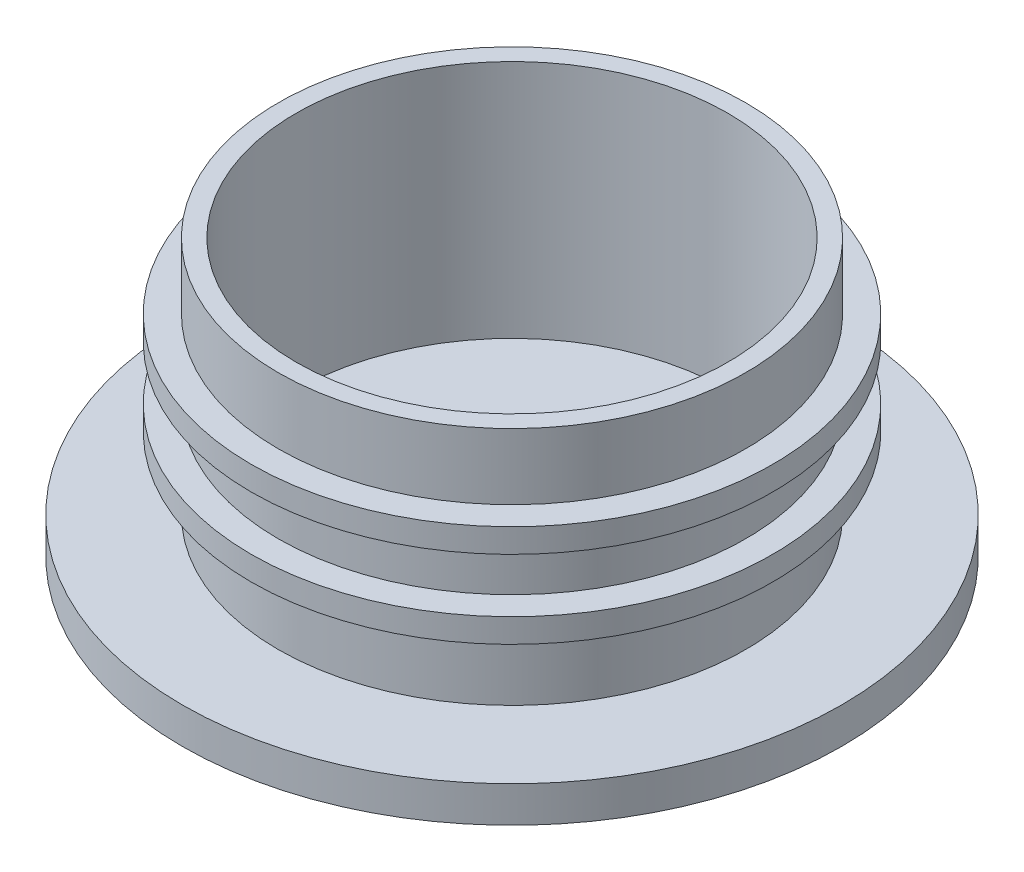
ISO-10303-21;
HEADER;
FILE_DESCRIPTION(('STEP AP214'),'2;1');
FILE_NAME('part.step','',(''),(''),'','','');
FILE_SCHEMA(('AUTOMOTIVE_DESIGN { 1 0 10303 214 1 1 1 1 }'));
ENDSEC;
DATA;
#1=APPLICATION_CONTEXT('core data for automotive mechanical design processes');
#2=APPLICATION_PROTOCOL_DEFINITION('international standard','automotive_design',2000,#1);
#3=PRODUCT_CONTEXT('',#1,'mechanical');
#4=PRODUCT('Part','Part','',(#3));
#5=PRODUCT_RELATED_PRODUCT_CATEGORY('part','',(#4));
#6=PRODUCT_DEFINITION_FORMATION('','',#4);
#7=PRODUCT_DEFINITION_CONTEXT('part definition',#1,'design');
#8=PRODUCT_DEFINITION('design','',#6,#7);
#9=PRODUCT_DEFINITION_SHAPE('','',#8);
#10=(LENGTH_UNIT() NAMED_UNIT(*) SI_UNIT(.MILLI.,.METRE.));
#11=(NAMED_UNIT(*) PLANE_ANGLE_UNIT() SI_UNIT($,.RADIAN.));
#12=(NAMED_UNIT(*) SI_UNIT($,.STERADIAN.) SOLID_ANGLE_UNIT());
#13=UNCERTAINTY_MEASURE_WITH_UNIT(LENGTH_MEASURE(1.E-05),#10,'distance_accuracy_value','');
#14=(GEOMETRIC_REPRESENTATION_CONTEXT(3) GLOBAL_UNCERTAINTY_ASSIGNED_CONTEXT((#13)) GLOBAL_UNIT_ASSIGNED_CONTEXT((#10,
#11,#12)) REPRESENTATION_CONTEXT('',''));
#15=CARTESIAN_POINT('',(0.,0.,0.));
#16=DIRECTION('',(0.,0.,1.));
#17=DIRECTION('',(1.,0.,0.));
#18=AXIS2_PLACEMENT_3D('',#15,#16,#17);
#19=CARTESIAN_POINT('',(0.,0.,0.));
#20=DIRECTION('',(0.,-1.,0.));
#21=DIRECTION('',(0.,0.,-1.));
#22=AXIS2_PLACEMENT_3D('',#19,#20,#21);
#23=PLANE('',#22);
#24=CARTESIAN_POINT('',(0.,0.,0.));
#25=DIRECTION('',(0.,1.,0.));
#26=DIRECTION('',(0.,0.,1.));
#27=AXIS2_PLACEMENT_3D('',#24,#25,#26);
#28=CIRCLE('',#27,18.);
#29=CARTESIAN_POINT('',(0.,0.,18.));
#30=VERTEX_POINT('',#29);
#31=EDGE_CURVE('E76',#30,#30,#28,.T.);
#32=ORIENTED_EDGE('',*,*,#31,.T.);
#33=EDGE_LOOP('',(#32));
#34=FACE_BOUND('',#33,.T.);
#35=ADVANCED_FACE('F35',(#34),#23,.F.);
#36=CARTESIAN_POINT('',(0.,20.,0.));
#37=DIRECTION('',(0.,-1.,0.));
#38=DIRECTION('',(0.,0.,-1.));
#39=AXIS2_PLACEMENT_3D('',#36,#37,#38);
#40=CYLINDRICAL_SURFACE('',#39,19.5);
#41=CARTESIAN_POINT('',(0.,8.,0.));
#42=DIRECTION('',(0.,1.,0.));
#43=DIRECTION('',(0.,0.,1.));
#44=AXIS2_PLACEMENT_3D('',#41,#42,#43);
#45=CIRCLE('',#44,19.5);
#46=CARTESIAN_POINT('',(0.,8.,19.5));
#47=VERTEX_POINT('',#46);
#48=EDGE_CURVE('E62',#47,#47,#45,.T.);
#49=ORIENTED_EDGE('',*,*,#48,.T.);
#50=EDGE_LOOP('',(#49));
#51=FACE_BOUND('',#50,.T.);
#52=CARTESIAN_POINT('',(0.,12.5,0.));
#53=DIRECTION('',(0.,1.,0.));
#54=DIRECTION('',(0.,0.,1.));
#55=AXIS2_PLACEMENT_3D('',#52,#53,#54);
#56=CIRCLE('',#55,19.5);
#57=CARTESIAN_POINT('',(0.,12.5,19.5));
#58=VERTEX_POINT('',#57);
#59=EDGE_CURVE('E10',#58,#58,#56,.T.);
#60=ORIENTED_EDGE('',*,*,#59,.F.);
#61=EDGE_LOOP('',(#60));
#62=FACE_BOUND('',#61,.T.);
#63=ADVANCED_FACE('F87',(#51,#62),#40,.T.);
#64=CARTESIAN_POINT('',(0.,0.,0.));
#65=DIRECTION('',(0.,1.,0.));
#66=DIRECTION('',(0.,0.,1.));
#67=AXIS2_PLACEMENT_3D('',#64,#65,#66);
#68=CIRCLE('',#67,19.5);
#69=CARTESIAN_POINT('',(0.,0.,19.5));
#70=VERTEX_POINT('',#69);
#71=EDGE_CURVE('E39',#70,#70,#68,.T.);
#72=ORIENTED_EDGE('',*,*,#71,.T.);
#73=EDGE_LOOP('',(#72));
#74=FACE_BOUND('',#73,.T.);
#75=CARTESIAN_POINT('',(0.,6.,0.));
#76=DIRECTION('',(0.,1.,0.));
#77=DIRECTION('',(0.,0.,1.));
#78=AXIS2_PLACEMENT_3D('',#75,#76,#77);
#79=CIRCLE('',#78,19.5);
#80=CARTESIAN_POINT('',(0.,6.,19.5));
#81=VERTEX_POINT('',#80);
#82=EDGE_CURVE('E43',#81,#81,#79,.T.);
#83=ORIENTED_EDGE('',*,*,#82,.F.);
#84=EDGE_LOOP('',(#83));
#85=FACE_BOUND('',#84,.T.);
#86=ADVANCED_FACE('F88',(#74,#85),#40,.T.);
#87=CARTESIAN_POINT('',(0.,-3.,0.));
#88=DIRECTION('',(0.,1.,0.));
#89=DIRECTION('',(0.,0.,1.));
#90=AXIS2_PLACEMENT_3D('',#87,#88,#89);
#91=CYLINDRICAL_SURFACE('',#90,27.5);
#92=CARTESIAN_POINT('',(0.,-3.,0.));
#93=DIRECTION('',(0.,-1.,0.));
#94=DIRECTION('',(0.,0.,-1.));
#95=AXIS2_PLACEMENT_3D('',#92,#93,#94);
#96=CIRCLE('',#95,27.5);
#97=CARTESIAN_POINT('',(0.,-3.,-27.5));
#98=VERTEX_POINT('',#97);
#99=EDGE_CURVE('E68',#98,#98,#96,.T.);
#100=ORIENTED_EDGE('',*,*,#99,.F.);
#101=EDGE_LOOP('',(#100));
#102=FACE_BOUND('',#101,.T.);
#103=CARTESIAN_POINT('',(0.,0.,0.));
#104=DIRECTION('',(0.,-1.,0.));
#105=DIRECTION('',(0.,0.,-1.));
#106=AXIS2_PLACEMENT_3D('',#103,#104,#105);
#107=CIRCLE('',#106,27.5);
#108=CARTESIAN_POINT('',(0.,0.,-27.5));
#109=VERTEX_POINT('',#108);
#110=EDGE_CURVE('E66',#109,#109,#107,.T.);
#111=ORIENTED_EDGE('',*,*,#110,.T.);
#112=EDGE_LOOP('',(#111));
#113=FACE_BOUND('',#112,.T.);
#114=ADVANCED_FACE('F99',(#102,#113),#91,.T.);
#115=CARTESIAN_POINT('',(0.,-3.,0.));
#116=DIRECTION('',(0.,-1.,0.));
#117=DIRECTION('',(0.,0.,-1.));
#118=AXIS2_PLACEMENT_3D('',#115,#116,#117);
#119=PLANE('',#118);
#120=ORIENTED_EDGE('',*,*,#99,.T.);
#121=EDGE_LOOP('',(#120));
#122=FACE_BOUND('',#121,.T.);
#123=ADVANCED_FACE('F111',(#122),#119,.T.);
#124=ORIENTED_EDGE('',*,*,#71,.F.);
#125=EDGE_LOOP('',(#124));
#126=FACE_BOUND('',#125,.T.);
#127=ORIENTED_EDGE('',*,*,#110,.F.);
#128=EDGE_LOOP('',(#127));
#129=FACE_BOUND('',#128,.T.);
#130=ADVANCED_FACE('F104',(#126,#129),#23,.F.);
#131=CARTESIAN_POINT('',(0.,6.,0.));
#132=DIRECTION('',(0.,1.,0.));
#133=DIRECTION('',(0.,0.,1.));
#134=AXIS2_PLACEMENT_3D('',#131,#132,#133);
#135=CYLINDRICAL_SURFACE('',#134,21.75);
#136=CARTESIAN_POINT('',(0.,6.,0.));
#137=DIRECTION('',(0.,1.,0.));
#138=DIRECTION('',(0.,0.,1.));
#139=AXIS2_PLACEMENT_3D('',#136,#137,#138);
#140=CIRCLE('',#139,21.75);
#141=CARTESIAN_POINT('',(0.,6.,21.75));
#142=VERTEX_POINT('',#141);
#143=EDGE_CURVE('E59',#142,#142,#140,.T.);
#144=ORIENTED_EDGE('',*,*,#143,.T.);
#145=EDGE_LOOP('',(#144));
#146=FACE_BOUND('',#145,.T.);
#147=CARTESIAN_POINT('',(0.,8.,0.));
#148=DIRECTION('',(0.,1.,0.));
#149=DIRECTION('',(0.,0.,1.));
#150=AXIS2_PLACEMENT_3D('',#147,#148,#149);
#151=CIRCLE('',#150,21.75);
#152=CARTESIAN_POINT('',(0.,8.,21.75));
#153=VERTEX_POINT('',#152);
#154=EDGE_CURVE('E57',#153,#153,#151,.T.);
#155=ORIENTED_EDGE('',*,*,#154,.F.);
#156=EDGE_LOOP('',(#155));
#157=FACE_BOUND('',#156,.T.);
#158=ADVANCED_FACE('F110',(#146,#157),#135,.T.);
#159=CARTESIAN_POINT('',(0.,6.,0.));
#160=DIRECTION('',(0.,1.,0.));
#161=DIRECTION('',(0.,0.,1.));
#162=AXIS2_PLACEMENT_3D('',#159,#160,#161);
#163=PLANE('',#162);
#164=ORIENTED_EDGE('',*,*,#82,.T.);
#165=EDGE_LOOP('',(#164));
#166=FACE_BOUND('',#165,.T.);
#167=ORIENTED_EDGE('',*,*,#143,.F.);
#168=EDGE_LOOP('',(#167));
#169=FACE_BOUND('',#168,.T.);
#170=ADVANCED_FACE('F117',(#166,#169),#163,.F.);
#171=CARTESIAN_POINT('',(0.,8.,0.));
#172=DIRECTION('',(0.,1.,0.));
#173=DIRECTION('',(0.,0.,1.));
#174=AXIS2_PLACEMENT_3D('',#171,#172,#173);
#175=PLANE('',#174);
#176=ORIENTED_EDGE('',*,*,#48,.F.);
#177=EDGE_LOOP('',(#176));
#178=FACE_BOUND('',#177,.T.);
#179=ORIENTED_EDGE('',*,*,#154,.T.);
#180=EDGE_LOOP('',(#179));
#181=FACE_BOUND('',#180,.T.);
#182=ADVANCED_FACE('F184',(#178,#181),#175,.T.);
#183=CARTESIAN_POINT('',(0.,14.5,0.));
#184=DIRECTION('',(0.,-1.,0.));
#185=DIRECTION('',(0.,0.,-1.));
#186=AXIS2_PLACEMENT_3D('',#183,#184,#185);
#187=CYLINDRICAL_SURFACE('',#186,21.75);
#188=CARTESIAN_POINT('',(0.,14.5,0.));
#189=DIRECTION('',(0.,1.,0.));
#190=DIRECTION('',(0.,0.,1.));
#191=AXIS2_PLACEMENT_3D('',#188,#189,#190);
#192=CIRCLE('',#191,21.75);
#193=CARTESIAN_POINT('',(0.,14.5,21.75));
#194=VERTEX_POINT('',#193);
#195=EDGE_CURVE('E58',#194,#194,#192,.T.);
#196=ORIENTED_EDGE('',*,*,#195,.F.);
#197=EDGE_LOOP('',(#196));
#198=FACE_BOUND('',#197,.T.);
#199=CARTESIAN_POINT('',(0.,12.5,0.));
#200=DIRECTION('',(0.,1.,0.));
#201=DIRECTION('',(0.,0.,1.));
#202=AXIS2_PLACEMENT_3D('',#199,#200,#201);
#203=CIRCLE('',#202,21.75);
#204=CARTESIAN_POINT('',(0.,12.5,21.75));
#205=VERTEX_POINT('',#204);
#206=EDGE_CURVE('E52',#205,#205,#203,.T.);
#207=ORIENTED_EDGE('',*,*,#206,.T.);
#208=EDGE_LOOP('',(#207));
#209=FACE_BOUND('',#208,.T.);
#210=ADVANCED_FACE('F194',(#198,#209),#187,.T.);
#211=CARTESIAN_POINT('',(0.,14.5,0.));
#212=DIRECTION('',(0.,1.,0.));
#213=DIRECTION('',(0.,0.,1.));
#214=AXIS2_PLACEMENT_3D('',#211,#212,#213);
#215=PLANE('',#214);
#216=CARTESIAN_POINT('',(0.,14.5,0.));
#217=DIRECTION('',(0.,1.,0.));
#218=DIRECTION('',(0.,0.,1.));
#219=AXIS2_PLACEMENT_3D('',#216,#217,#218);
#220=CIRCLE('',#219,19.5);
#221=CARTESIAN_POINT('',(0.,14.5,19.5));
#222=VERTEX_POINT('',#221);
#223=EDGE_CURVE('E54',#222,#222,#220,.T.);
#224=ORIENTED_EDGE('',*,*,#223,.F.);
#225=EDGE_LOOP('',(#224));
#226=FACE_BOUND('',#225,.T.);
#227=ORIENTED_EDGE('',*,*,#195,.T.);
#228=EDGE_LOOP('',(#227));
#229=FACE_BOUND('',#228,.T.);
#230=ADVANCED_FACE('F94',(#226,#229),#215,.T.);
#231=CARTESIAN_POINT('',(0.,12.5,0.));
#232=DIRECTION('',(0.,1.,0.));
#233=DIRECTION('',(0.,0.,1.));
#234=AXIS2_PLACEMENT_3D('',#231,#232,#233);
#235=PLANE('',#234);
#236=ORIENTED_EDGE('',*,*,#59,.T.);
#237=EDGE_LOOP('',(#236));
#238=FACE_BOUND('',#237,.T.);
#239=ORIENTED_EDGE('',*,*,#206,.F.);
#240=EDGE_LOOP('',(#239));
#241=FACE_BOUND('',#240,.T.);
#242=ADVANCED_FACE('F85',(#238,#241),#235,.F.);
#243=ORIENTED_EDGE('',*,*,#223,.T.);
#244=EDGE_LOOP('',(#243));
#245=FACE_BOUND('',#244,.T.);
#246=CARTESIAN_POINT('',(0.,20.,0.));
#247=DIRECTION('',(0.,1.,0.));
#248=DIRECTION('',(0.,0.,1.));
#249=AXIS2_PLACEMENT_3D('',#246,#247,#248);
#250=CIRCLE('',#249,19.5);
#251=CARTESIAN_POINT('',(0.,20.,19.5));
#252=VERTEX_POINT('',#251);
#253=EDGE_CURVE('E48',#252,#252,#250,.T.);
#254=ORIENTED_EDGE('',*,*,#253,.F.);
#255=EDGE_LOOP('',(#254));
#256=FACE_BOUND('',#255,.T.);
#257=ADVANCED_FACE('F37',(#245,#256),#40,.T.);
#258=CARTESIAN_POINT('',(0.,20.,0.));
#259=DIRECTION('',(0.,1.,0.));
#260=DIRECTION('',(0.,0.,1.));
#261=AXIS2_PLACEMENT_3D('',#258,#259,#260);
#262=PLANE('',#261);
#263=ORIENTED_EDGE('',*,*,#253,.T.);
#264=EDGE_LOOP('',(#263));
#265=FACE_BOUND('',#264,.T.);
#266=CARTESIAN_POINT('',(0.,20.,0.));
#267=DIRECTION('',(0.,1.,0.));
#268=DIRECTION('',(0.,0.,1.));
#269=AXIS2_PLACEMENT_3D('',#266,#267,#268);
#270=CIRCLE('',#269,18.);
#271=CARTESIAN_POINT('',(0.,20.,18.));
#272=VERTEX_POINT('',#271);
#273=EDGE_CURVE('E73',#272,#272,#270,.T.);
#274=ORIENTED_EDGE('',*,*,#273,.F.);
#275=EDGE_LOOP('',(#274));
#276=FACE_BOUND('',#275,.T.);
#277=ADVANCED_FACE('F81',(#265,#276),#262,.T.);
#278=CARTESIAN_POINT('',(0.,20.,0.));
#279=DIRECTION('',(0.,-1.,0.));
#280=DIRECTION('',(0.,0.,-1.));
#281=AXIS2_PLACEMENT_3D('',#278,#279,#280);
#282=CYLINDRICAL_SURFACE('',#281,18.);
#283=ORIENTED_EDGE('',*,*,#273,.T.);
#284=EDGE_LOOP('',(#283));
#285=FACE_BOUND('',#284,.T.);
#286=ORIENTED_EDGE('',*,*,#31,.F.);
#287=EDGE_LOOP('',(#286));
#288=FACE_BOUND('',#287,.T.);
#289=ADVANCED_FACE('F93',(#285,#288),#282,.F.);
#290=CLOSED_SHELL('',(#35,#63,#86,#114,#123,#130,#158,#170,#182,#210,#230,#242,#257,#277,#289));
#291=MANIFOLD_SOLID_BREP('B2',#290);
#292=ADVANCED_BREP_SHAPE_REPRESENTATION('',(#18,#291),#14);
#293=SHAPE_DEFINITION_REPRESENTATION(#9,#292);
ENDSEC;
END-ISO-10303-21;
